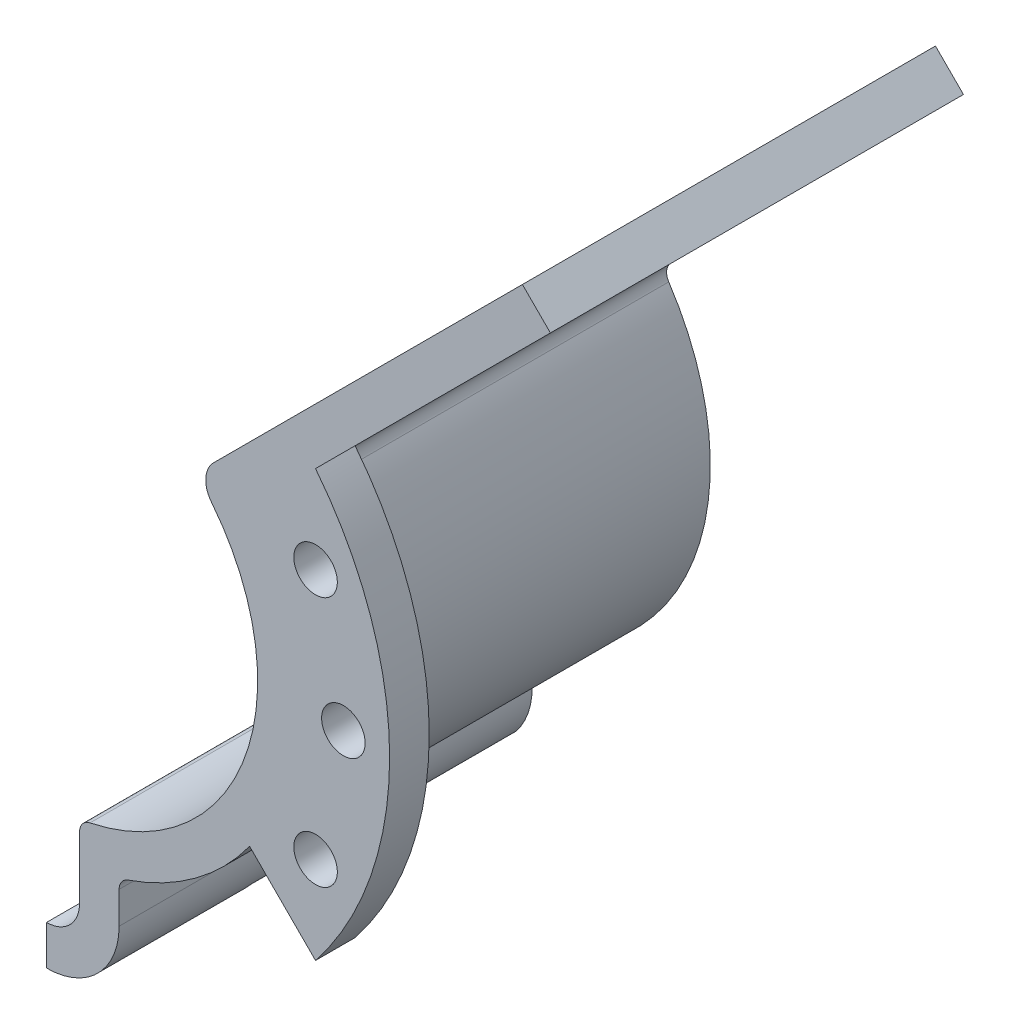
ISO-10303-21;
HEADER;
FILE_DESCRIPTION(('STEP AP214'),'2;1');
FILE_NAME('part.step','',(''),(''),'','','');
FILE_SCHEMA(('AUTOMOTIVE_DESIGN { 1 0 10303 214 1 1 1 1 }'));
ENDSEC;
DATA;
#1=APPLICATION_CONTEXT('core data for automotive mechanical design processes');
#2=APPLICATION_PROTOCOL_DEFINITION('international standard','automotive_design',2000,#1);
#3=PRODUCT_CONTEXT('',#1,'mechanical');
#4=PRODUCT('Part','Part','',(#3));
#5=PRODUCT_RELATED_PRODUCT_CATEGORY('part','',(#4));
#6=PRODUCT_DEFINITION_FORMATION('','',#4);
#7=PRODUCT_DEFINITION_CONTEXT('part definition',#1,'design');
#8=PRODUCT_DEFINITION('design','',#6,#7);
#9=PRODUCT_DEFINITION_SHAPE('','',#8);
#10=(LENGTH_UNIT() NAMED_UNIT(*) SI_UNIT(.MILLI.,.METRE.));
#11=(NAMED_UNIT(*) PLANE_ANGLE_UNIT() SI_UNIT($,.RADIAN.));
#12=(NAMED_UNIT(*) SI_UNIT($,.STERADIAN.) SOLID_ANGLE_UNIT());
#13=UNCERTAINTY_MEASURE_WITH_UNIT(LENGTH_MEASURE(1.E-05),#10,'distance_accuracy_value','');
#14=(GEOMETRIC_REPRESENTATION_CONTEXT(3) GLOBAL_UNCERTAINTY_ASSIGNED_CONTEXT((#13)) GLOBAL_UNIT_ASSIGNED_CONTEXT((#10,
#11,#12)) REPRESENTATION_CONTEXT('',''));
#15=CARTESIAN_POINT('',(0.,0.,0.));
#16=DIRECTION('',(0.,0.,1.));
#17=DIRECTION('',(1.,0.,0.));
#18=AXIS2_PLACEMENT_3D('',#15,#16,#17);
#19=CARTESIAN_POINT('',(0.,-21.3348082018374,-40.2490319383578));
#20=DIRECTION('',(0.,0.,1.));
#21=DIRECTION('',(-1.,0.,0.));
#22=AXIS2_PLACEMENT_3D('',#19,#20,#21);
#23=CYLINDRICAL_SURFACE('',#22,2.49999999999986);
#24=CARTESIAN_POINT('',(0.,-21.3348082018374,-10.));
#25=DIRECTION('',(0.,0.,1.));
#26=DIRECTION('',(1.,0.,0.));
#27=AXIS2_PLACEMENT_3D('',#24,#25,#26);
#28=CIRCLE('',#27,2.49999999999986);
#29=CARTESIAN_POINT('',(2.49999999999986,-21.3348082018374,-10.));
#30=VERTEX_POINT('',#29);
#31=CARTESIAN_POINT('',(0.,-23.8348082018372,-10.));
#32=VERTEX_POINT('',#31);
#33=EDGE_CURVE('E182',#30,#32,#28,.F.);
#34=ORIENTED_EDGE('',*,*,#33,.T.);
#35=DIRECTION('',(0.,0.,1.));
#36=VECTOR('',#35,1.);
#37=CARTESIAN_POINT('',(0.,-23.8348082018372,-40.2490319383578));
#38=LINE('',#37,#36);
#39=CARTESIAN_POINT('',(0.,-23.8348082018372,1.3));
#40=VERTEX_POINT('',#39);
#41=EDGE_CURVE('E204',#32,#40,#38,.T.);
#42=ORIENTED_EDGE('',*,*,#41,.T.);
#43=CARTESIAN_POINT('',(0.,-21.3348082018374,1.3));
#44=DIRECTION('',(0.,0.,-1.));
#45=DIRECTION('',(-1.,0.,0.));
#46=AXIS2_PLACEMENT_3D('',#43,#44,#45);
#47=CIRCLE('',#46,2.49999999999986);
#48=CARTESIAN_POINT('',(2.49999999999986,-21.3348082018374,1.3));
#49=VERTEX_POINT('',#48);
#50=EDGE_CURVE('E184',#49,#40,#47,.T.);
#51=ORIENTED_EDGE('',*,*,#50,.F.);
#52=DIRECTION('',(0.,0.,1.));
#53=VECTOR('',#52,1.);
#54=CARTESIAN_POINT('',(2.49999999999986,-21.3348082018374,-40.2490319383578));
#55=LINE('',#54,#53);
#56=EDGE_CURVE('E169',#30,#49,#55,.T.);
#57=ORIENTED_EDGE('',*,*,#56,.F.);
#58=EDGE_LOOP('',(#34,#42,#51,#57));
#59=FACE_BOUND('',#58,.T.);
#60=ADVANCED_FACE('F35',(#59),#23,.F.);
#61=CARTESIAN_POINT('',(0.,-23.8348082018372,-40.2490319383578));
#62=DIRECTION('',(1.,0.,0.));
#63=DIRECTION('',(0.,1.,0.));
#64=AXIS2_PLACEMENT_3D('',#61,#62,#63);
#65=PLANE('',#64);
#66=DIRECTION('',(0.,-1.,0.));
#67=VECTOR('',#66,1.);
#68=CARTESIAN_POINT('',(0.,-23.8348082018372,-10.));
#69=LINE('',#68,#67);
#70=CARTESIAN_POINT('',(0.,-26.8348082018372,-10.));
#71=VERTEX_POINT('',#70);
#72=EDGE_CURVE('E176',#32,#71,#69,.T.);
#73=ORIENTED_EDGE('',*,*,#72,.T.);
#74=DIRECTION('',(0.,0.,1.));
#75=VECTOR('',#74,1.);
#76=CARTESIAN_POINT('',(0.,-26.8348082018372,-40.2490319383578));
#77=LINE('',#76,#75);
#78=CARTESIAN_POINT('',(0.,-26.8348082018372,1.3));
#79=VERTEX_POINT('',#78);
#80=EDGE_CURVE('E200',#71,#79,#77,.T.);
#81=ORIENTED_EDGE('',*,*,#80,.T.);
#82=DIRECTION('',(0.,-1.,0.));
#83=VECTOR('',#82,1.);
#84=CARTESIAN_POINT('',(0.,-23.8348082018372,1.3));
#85=LINE('',#84,#83);
#86=EDGE_CURVE('E201',#40,#79,#85,.T.);
#87=ORIENTED_EDGE('',*,*,#86,.F.);
#88=ORIENTED_EDGE('',*,*,#41,.F.);
#89=EDGE_LOOP('',(#73,#81,#87,#88));
#90=FACE_BOUND('',#89,.T.);
#91=ADVANCED_FACE('F380',(#90),#65,.F.);
#92=CARTESIAN_POINT('',(0.,0.,-95.4754890815647));
#93=DIRECTION('',(0.,0.,1.));
#94=DIRECTION('',(-1.,0.,0.));
#95=AXIS2_PLACEMENT_3D('',#92,#93,#94);
#96=CYLINDRICAL_SURFACE('',#95,19.);
#97=CARTESIAN_POINT('',(0.,0.,-30.));
#98=DIRECTION('',(0.,0.,1.));
#99=DIRECTION('',(1.,0.,0.));
#100=AXIS2_PLACEMENT_3D('',#97,#98,#99);
#101=CIRCLE('',#100,19.);
#102=CARTESIAN_POINT('',(6.17499999999986,-17.9685663034089,-30.));
#103=VERTEX_POINT('',#102);
#104=CARTESIAN_POINT('',(15.8505919060323,10.4765803690146,-30.));
#105=VERTEX_POINT('',#104);
#106=EDGE_CURVE('E258',#103,#105,#101,.T.);
#107=ORIENTED_EDGE('',*,*,#106,.T.);
#108=DIRECTION('',(0.,0.,1.));
#109=VECTOR('',#108,1.);
#110=CARTESIAN_POINT('',(15.8505919060323,10.4765803690146,-95.4754890815647));
#111=LINE('',#110,#109);
#112=CARTESIAN_POINT('',(15.8505919060323,10.4765803690146,-1.7));
#113=VERTEX_POINT('',#112);
#114=EDGE_CURVE('E293',#113,#105,#111,.F.);
#115=ORIENTED_EDGE('',*,*,#114,.F.);
#116=CARTESIAN_POINT('',(0.,0.,-1.7));
#117=DIRECTION('',(0.,0.,-1.));
#118=DIRECTION('',(1.,0.,0.));
#119=AXIS2_PLACEMENT_3D('',#116,#117,#118);
#120=CIRCLE('',#119,19.);
#121=CARTESIAN_POINT('',(15.3878195049812,-11.145178817862,-1.70000000000001));
#122=VERTEX_POINT('',#121);
#123=EDGE_CURVE('E222',#113,#122,#120,.T.);
#124=ORIENTED_EDGE('',*,*,#123,.T.);
#125=DIRECTION('',(0.,0.,1.));
#126=VECTOR('',#125,1.);
#127=CARTESIAN_POINT('',(15.3878195049812,-11.145178817862,-1.7));
#128=LINE('',#127,#126);
#129=CARTESIAN_POINT('',(15.3878195049812,-11.145178817862,1.3));
#130=VERTEX_POINT('',#129);
#131=EDGE_CURVE('E232',#122,#130,#128,.T.);
#132=ORIENTED_EDGE('',*,*,#131,.T.);
#133=CARTESIAN_POINT('',(0.,0.,1.3));
#134=DIRECTION('',(0.,0.,1.));
#135=DIRECTION('',(1.,0.,0.));
#136=AXIS2_PLACEMENT_3D('',#133,#134,#135);
#137=CIRCLE('',#136,19.);
#138=CARTESIAN_POINT('',(6.17499999999986,-17.9685663034089,1.3));
#139=VERTEX_POINT('',#138);
#140=EDGE_CURVE('E243',#139,#130,#137,.T.);
#141=ORIENTED_EDGE('',*,*,#140,.F.);
#142=DIRECTION('',(0.,0.,1.));
#143=VECTOR('',#142,1.);
#144=CARTESIAN_POINT('',(6.17499999999986,-17.9685663034089,-95.4754890815647));
#145=LINE('',#144,#143);
#146=EDGE_CURVE('E296',#103,#139,#145,.T.);
#147=ORIENTED_EDGE('',*,*,#146,.F.);
#148=EDGE_LOOP('',(#107,#115,#124,#132,#141,#147));
#149=FACE_BOUND('',#148,.T.);
#150=ADVANCED_FACE('F346',(#149),#96,.T.);
#151=CARTESIAN_POINT('',(38.1837661840735,33.9411254969544,-95.4754890815647));
#152=DIRECTION('',(-0.707106781186549,0.707106781186546,0.));
#153=DIRECTION('',(-0.707106781186546,-0.707106781186549,0.));
#154=AXIS2_PLACEMENT_3D('',#151,#152,#153);
#155=PLANE('',#154);
#156=DIRECTION('',(0.707106781186546,0.707106781186549,0.));
#157=VECTOR('',#156,1.);
#158=CARTESIAN_POINT('',(38.1837661840735,33.9411254969544,-30.));
#159=LINE('',#158,#157);
#160=CARTESIAN_POINT('',(15.9777268041106,11.7350861169914,-30.));
#161=VERTEX_POINT('',#160);
#162=CARTESIAN_POINT('',(38.1837661840735,33.9411254969544,-30.));
#163=VERTEX_POINT('',#162);
#164=EDGE_CURVE('E242',#161,#163,#159,.T.);
#165=ORIENTED_EDGE('',*,*,#164,.T.);
#166=DIRECTION('',(0.,0.,1.));
#167=VECTOR('',#166,1.);
#168=CARTESIAN_POINT('',(38.1837661840735,33.9411254969544,-95.4754890815647));
#169=LINE('',#168,#167);
#170=CARTESIAN_POINT('',(38.1837661840735,33.9411254969544,1.3));
#171=VERTEX_POINT('',#170);
#172=EDGE_CURVE('E238',#163,#171,#169,.T.);
#173=ORIENTED_EDGE('',*,*,#172,.T.);
#174=DIRECTION('',(0.707106781186546,0.707106781186549,0.));
#175=VECTOR('',#174,1.);
#176=CARTESIAN_POINT('',(38.1837661840735,33.9411254969544,1.3));
#177=LINE('',#176,#175);
#178=CARTESIAN_POINT('',(20.3833027113093,16.1406620241901,1.3));
#179=VERTEX_POINT('',#178);
#180=EDGE_CURVE('E239',#179,#171,#177,.T.);
#181=ORIENTED_EDGE('',*,*,#180,.F.);
#182=DIRECTION('',(0.,0.,1.));
#183=VECTOR('',#182,1.);
#184=CARTESIAN_POINT('',(20.3833027113093,16.1406620241901,-1.7));
#185=LINE('',#184,#183);
#186=CARTESIAN_POINT('',(20.3833027113093,16.1406620241901,-1.70000000000001));
#187=VERTEX_POINT('',#186);
#188=EDGE_CURVE('E235',#187,#179,#185,.T.);
#189=ORIENTED_EDGE('',*,*,#188,.F.);
#190=DIRECTION('',(-0.707106781186547,-0.707106781186548,0.));
#191=VECTOR('',#190,1.);
#192=CARTESIAN_POINT('',(15.3878195049812,11.145178817862,-1.7));
#193=LINE('',#192,#191);
#194=CARTESIAN_POINT('',(15.9777268041106,11.7350861169914,-1.7));
#195=VERTEX_POINT('',#194);
#196=EDGE_CURVE('E218',#187,#195,#193,.T.);
#197=ORIENTED_EDGE('',*,*,#196,.T.);
#198=DIRECTION('',(0.,0.,-1.));
#199=VECTOR('',#198,1.);
#200=CARTESIAN_POINT('',(15.9777268041106,11.7350861169914,-1.70000000000006));
#201=LINE('',#200,#199);
#202=EDGE_CURVE('E306',#161,#195,#201,.F.);
#203=ORIENTED_EDGE('',*,*,#202,.F.);
#204=EDGE_LOOP('',(#165,#173,#181,#189,#197,#203));
#205=FACE_BOUND('',#204,.T.);
#206=ADVANCED_FACE('F334',(#205),#155,.F.);
#207=CARTESIAN_POINT('',(36.0624458405138,36.062445840514,-95.4754890815647));
#208=DIRECTION('',(-0.707106781186544,-0.707106781186551,0.));
#209=DIRECTION('',(0.707106781186551,-0.707106781186544,0.));
#210=AXIS2_PLACEMENT_3D('',#207,#208,#209);
#211=PLANE('',#210);
#212=DIRECTION('',(-0.707106781186551,0.707106781186544,0.));
#213=VECTOR('',#212,1.);
#214=CARTESIAN_POINT('',(36.0624458405138,36.062445840514,-30.));
#215=LINE('',#214,#213);
#216=CARTESIAN_POINT('',(36.0624458405138,36.062445840514,-30.));
#217=VERTEX_POINT('',#216);
#218=EDGE_CURVE('E270',#163,#217,#215,.T.);
#219=ORIENTED_EDGE('',*,*,#218,.T.);
#220=DIRECTION('',(0.,0.,1.));
#221=VECTOR('',#220,1.);
#222=CARTESIAN_POINT('',(36.0624458405138,36.062445840514,-95.4754890815647));
#223=LINE('',#222,#221);
#224=CARTESIAN_POINT('',(36.0624458405138,36.062445840514,1.3));
#225=VERTEX_POINT('',#224);
#226=EDGE_CURVE('E254',#217,#225,#223,.T.);
#227=ORIENTED_EDGE('',*,*,#226,.T.);
#228=DIRECTION('',(-0.707106781186551,0.707106781186544,0.));
#229=VECTOR('',#228,1.);
#230=CARTESIAN_POINT('',(36.0624458405138,36.062445840514,1.3));
#231=LINE('',#230,#229);
#232=EDGE_CURVE('E255',#171,#225,#231,.T.);
#233=ORIENTED_EDGE('',*,*,#232,.F.);
#234=ORIENTED_EDGE('',*,*,#172,.F.);
#235=EDGE_LOOP('',(#219,#227,#233,#234));
#236=FACE_BOUND('',#235,.T.);
#237=ADVANCED_FACE('F330',(#236),#211,.F.);
#238=CARTESIAN_POINT('',(36.0624458405138,36.062445840514,-95.4754890815647));
#239=DIRECTION('',(0.707106781186549,-0.707106781186546,0.));
#240=DIRECTION('',(0.707106781186546,0.707106781186549,0.));
#241=AXIS2_PLACEMENT_3D('',#238,#239,#240);
#242=PLANE('',#241);
#243=DIRECTION('',(-0.707106781186546,-0.707106781186549,0.));
#244=VECTOR('',#243,1.);
#245=CARTESIAN_POINT('',(36.0624458405138,36.062445840514,1.3));
#246=LINE('',#245,#244);
#247=CARTESIAN_POINT('',(12.6491106406735,12.6491106406735,1.3));
#248=VERTEX_POINT('',#247);
#249=EDGE_CURVE('E251',#225,#248,#246,.T.);
#250=ORIENTED_EDGE('',*,*,#249,.F.);
#251=ORIENTED_EDGE('',*,*,#226,.F.);
#252=DIRECTION('',(-0.707106781186546,-0.707106781186549,0.));
#253=VECTOR('',#252,1.);
#254=CARTESIAN_POINT('',(36.0624458405138,36.062445840514,-30.));
#255=LINE('',#254,#253);
#256=CARTESIAN_POINT('',(12.6491106406735,12.6491106406735,-30.));
#257=VERTEX_POINT('',#256);
#258=EDGE_CURVE('E267',#217,#257,#255,.T.);
#259=ORIENTED_EDGE('',*,*,#258,.T.);
#260=DIRECTION('',(0.,0.,1.));
#261=VECTOR('',#260,1.);
#262=CARTESIAN_POINT('',(12.6491106406735,12.6491106406735,-95.4754890815647));
#263=LINE('',#262,#261);
#264=EDGE_CURVE('E43',#248,#257,#263,.F.);
#265=ORIENTED_EDGE('',*,*,#264,.F.);
#266=EDGE_LOOP('',(#250,#251,#259,#265));
#267=FACE_BOUND('',#266,.T.);
#268=ADVANCED_FACE('F325',(#267),#242,.F.);
#269=CARTESIAN_POINT('',(0.,0.,-95.4754890815647));
#270=DIRECTION('',(0.,0.,1.));
#271=DIRECTION('',(-1.,0.,0.));
#272=AXIS2_PLACEMENT_3D('',#269,#270,#271);
#273=CYLINDRICAL_SURFACE('',#272,16.);
#274=CARTESIAN_POINT('',(0.,0.,-30.));
#275=DIRECTION('',(0.,0.,1.));
#276=DIRECTION('',(1.,0.,0.));
#277=AXIS2_PLACEMENT_3D('',#274,#275,#276);
#278=CIRCLE('',#277,16.);
#279=CARTESIAN_POINT('',(12.5007326249303,9.98657518071152,-30.));
#280=VERTEX_POINT('',#279);
#281=CARTESIAN_POINT('',(3.29411764705869,-15.6572280090486,-30.));
#282=VERTEX_POINT('',#281);
#283=EDGE_CURVE('E264',#280,#282,#278,.F.);
#284=ORIENTED_EDGE('',*,*,#283,.T.);
#285=DIRECTION('',(0.,0.,1.));
#286=VECTOR('',#285,1.);
#287=CARTESIAN_POINT('',(3.29411764705869,-15.6572280090486,-95.4754890815647));
#288=LINE('',#287,#286);
#289=CARTESIAN_POINT('',(3.29411764705869,-15.6572280090486,1.3));
#290=VERTEX_POINT('',#289);
#291=EDGE_CURVE('E303',#290,#282,#288,.F.);
#292=ORIENTED_EDGE('',*,*,#291,.F.);
#293=CARTESIAN_POINT('',(0.,0.,1.3));
#294=DIRECTION('',(0.,0.,-1.));
#295=DIRECTION('',(1.,0.,0.));
#296=AXIS2_PLACEMENT_3D('',#293,#294,#295);
#297=CIRCLE('',#296,16.);
#298=CARTESIAN_POINT('',(12.5007326249303,9.98657518071152,1.3));
#299=VERTEX_POINT('',#298);
#300=EDGE_CURVE('E248',#299,#290,#297,.T.);
#301=ORIENTED_EDGE('',*,*,#300,.F.);
#302=DIRECTION('',(0.,0.,1.));
#303=VECTOR('',#302,1.);
#304=CARTESIAN_POINT('',(12.5007326249303,9.98657518071152,-95.4754890815647));
#305=LINE('',#304,#303);
#306=EDGE_CURVE('E320',#280,#299,#305,.T.);
#307=ORIENTED_EDGE('',*,*,#306,.F.);
#308=EDGE_LOOP('',(#284,#292,#301,#307));
#309=FACE_BOUND('',#308,.T.);
#310=ADVANCED_FACE('F366',(#309),#273,.F.);
#311=CARTESIAN_POINT('',(2.49999999999986,-15.8034806292791,-95.4754890815647));
#312=DIRECTION('',(1.,0.,0.));
#313=DIRECTION('',(0.,0.,1.));
#314=AXIS2_PLACEMENT_3D('',#311,#312,#313);
#315=PLANE('',#314);
#316=DIRECTION('',(0.,1.,0.));
#317=VECTOR('',#316,1.);
#318=CARTESIAN_POINT('',(2.49999999999986,-21.3348082018374,-10.));
#319=LINE('',#318,#317);
#320=CARTESIAN_POINT('',(2.49999999999986,-24.1632353265835,-10.));
#321=VERTEX_POINT('',#320);
#322=EDGE_CURVE('E165',#321,#30,#319,.T.);
#323=ORIENTED_EDGE('',*,*,#322,.T.);
#324=ORIENTED_EDGE('',*,*,#56,.T.);
#325=DIRECTION('',(0.,-1.,0.));
#326=VECTOR('',#325,1.);
#327=CARTESIAN_POINT('',(2.49999999999986,-15.8034806292791,1.3));
#328=LINE('',#327,#326);
#329=CARTESIAN_POINT('',(2.49999999999986,-16.6358047596142,1.3));
#330=VERTEX_POINT('',#329);
#331=EDGE_CURVE('E246',#330,#49,#328,.T.);
#332=ORIENTED_EDGE('',*,*,#331,.F.);
#333=DIRECTION('',(0.,0.,1.));
#334=VECTOR('',#333,1.);
#335=CARTESIAN_POINT('',(2.49999999999986,-16.6358047596142,-95.4754890815647));
#336=LINE('',#335,#334);
#337=CARTESIAN_POINT('',(2.49999999999986,-16.6358047596142,-30.));
#338=VERTEX_POINT('',#337);
#339=EDGE_CURVE('E284',#338,#330,#336,.T.);
#340=ORIENTED_EDGE('',*,*,#339,.F.);
#341=DIRECTION('',(0.,-1.,0.));
#342=VECTOR('',#341,1.);
#343=CARTESIAN_POINT('',(2.49999999999986,-15.8034806292791,-30.));
#344=LINE('',#343,#342);
#345=CARTESIAN_POINT('',(2.49999999999986,-24.1632353265835,-30.));
#346=VERTEX_POINT('',#345);
#347=EDGE_CURVE('E262',#338,#346,#344,.T.);
#348=ORIENTED_EDGE('',*,*,#347,.T.);
#349=DIRECTION('',(0.,0.,1.));
#350=VECTOR('',#349,1.);
#351=CARTESIAN_POINT('',(2.49999999999986,-24.1632353265835,-95.4754890815647));
#352=LINE('',#351,#350);
#353=EDGE_CURVE('E173',#321,#346,#352,.F.);
#354=ORIENTED_EDGE('',*,*,#353,.F.);
#355=EDGE_LOOP('',(#323,#324,#332,#340,#348,#354));
#356=FACE_BOUND('',#355,.T.);
#357=ADVANCED_FACE('F167',(#356),#315,.F.);
#358=CARTESIAN_POINT('',(0.,0.,1.3));
#359=DIRECTION('',(0.,0.,-1.));
#360=DIRECTION('',(1.,0.,0.));
#361=AXIS2_PLACEMENT_3D('',#358,#359,#360);
#362=PLANE('',#361);
#363=CARTESIAN_POINT('',(22.4949455159964,0.,1.3));
#364=DIRECTION('',(0.,0.,1.));
#365=DIRECTION('',(1.,0.,0.));
#366=AXIS2_PLACEMENT_3D('',#363,#364,#365);
#367=CIRCLE('',#366,1.65);
#368=CARTESIAN_POINT('',(24.1449455159964,0.,1.3));
#369=VERTEX_POINT('',#368);
#370=EDGE_CURVE('E610',#369,#369,#367,.T.);
#371=ORIENTED_EDGE('',*,*,#370,.F.);
#372=EDGE_LOOP('',(#371));
#373=FACE_BOUND('',#372,.T.);
#374=CARTESIAN_POINT('',(20.3873442901127,9.50677477192217,1.3));
#375=DIRECTION('',(0.,0.,1.));
#376=DIRECTION('',(1.,0.,0.));
#377=AXIS2_PLACEMENT_3D('',#374,#375,#376);
#378=CIRCLE('',#377,1.65);
#379=CARTESIAN_POINT('',(22.0373442901127,9.50677477192217,1.3));
#380=VERTEX_POINT('',#379);
#381=EDGE_CURVE('E601',#380,#380,#378,.T.);
#382=ORIENTED_EDGE('',*,*,#381,.F.);
#383=EDGE_LOOP('',(#382));
#384=FACE_BOUND('',#383,.T.);
#385=CARTESIAN_POINT('',(20.3873442901127,-9.50677477192216,1.3));
#386=DIRECTION('',(0.,0.,1.));
#387=DIRECTION('',(1.,0.,0.));
#388=AXIS2_PLACEMENT_3D('',#385,#386,#387);
#389=CIRCLE('',#388,1.65);
#390=CARTESIAN_POINT('',(22.0373442901127,-9.50677477192216,1.3));
#391=VERTEX_POINT('',#390);
#392=EDGE_CURVE('E177',#391,#391,#389,.T.);
#393=ORIENTED_EDGE('',*,*,#392,.F.);
#394=EDGE_LOOP('',(#393));
#395=FACE_BOUND('',#394,.T.);
#396=ORIENTED_EDGE('',*,*,#300,.T.);
#397=CARTESIAN_POINT('',(3.49999999999986,-16.6358047596142,1.3));
#398=DIRECTION('',(0.,0.,1.));
#399=DIRECTION('',(1.,0.,0.));
#400=AXIS2_PLACEMENT_3D('',#397,#398,#399);
#401=CIRCLE('',#400,1.);
#402=EDGE_CURVE('E301',#330,#290,#401,.F.);
#403=ORIENTED_EDGE('',*,*,#402,.F.);
#404=ORIENTED_EDGE('',*,*,#331,.T.);
#405=ORIENTED_EDGE('',*,*,#50,.T.);
#406=ORIENTED_EDGE('',*,*,#86,.T.);
#407=CARTESIAN_POINT('',(0.,-21.3348082018374,1.3));
#408=DIRECTION('',(0.,0.,1.));
#409=DIRECTION('',(1.,0.,0.));
#410=AXIS2_PLACEMENT_3D('',#407,#408,#409);
#411=CIRCLE('',#410,5.49999999999986);
#412=CARTESIAN_POINT('',(5.49999999999986,-21.3348082018374,1.3));
#413=VERTEX_POINT('',#412);
#414=EDGE_CURVE('E197',#79,#413,#411,.T.);
#415=ORIENTED_EDGE('',*,*,#414,.T.);
#416=DIRECTION('',(0.,1.,0.));
#417=VECTOR('',#416,1.);
#418=CARTESIAN_POINT('',(5.49999999999986,-21.3348082018374,1.3));
#419=LINE('',#418,#417);
#420=CARTESIAN_POINT('',(5.49999999999986,-18.9142803193778,1.3));
#421=VERTEX_POINT('',#420);
#422=EDGE_CURVE('E192',#413,#421,#419,.T.);
#423=ORIENTED_EDGE('',*,*,#422,.T.);
#424=CARTESIAN_POINT('',(6.49999999999986,-18.9142803193778,1.3));
#425=DIRECTION('',(0.,0.,1.));
#426=DIRECTION('',(1.,0.,0.));
#427=AXIS2_PLACEMENT_3D('',#424,#425,#426);
#428=CIRCLE('',#427,1.);
#429=EDGE_CURVE('E313',#139,#421,#428,.T.);
#430=ORIENTED_EDGE('',*,*,#429,.F.);
#431=ORIENTED_EDGE('',*,*,#140,.T.);
#432=DIRECTION('',(0.707106781186547,-0.707106781186548,0.));
#433=VECTOR('',#432,1.);
#434=CARTESIAN_POINT('',(15.3878195049812,-11.145178817862,1.3));
#435=LINE('',#434,#433);
#436=CARTESIAN_POINT('',(20.3833027113093,-16.1406620241901,1.3));
#437=VERTEX_POINT('',#436);
#438=EDGE_CURVE('E219',#130,#437,#435,.T.);
#439=ORIENTED_EDGE('',*,*,#438,.T.);
#440=CARTESIAN_POINT('',(0.,0.,1.3));
#441=DIRECTION('',(0.,0.,1.));
#442=DIRECTION('',(-1.,0.,0.));
#443=AXIS2_PLACEMENT_3D('',#440,#441,#442);
#444=CIRCLE('',#443,26.);
#445=EDGE_CURVE('E209',#437,#179,#444,.T.);
#446=ORIENTED_EDGE('',*,*,#445,.T.);
#447=ORIENTED_EDGE('',*,*,#180,.T.);
#448=ORIENTED_EDGE('',*,*,#232,.T.);
#449=ORIENTED_EDGE('',*,*,#249,.T.);
#450=CARTESIAN_POINT('',(14.0633242030466,11.2348970783005,1.3));
#451=DIRECTION('',(0.,0.,1.));
#452=DIRECTION('',(1.,0.,0.));
#453=AXIS2_PLACEMENT_3D('',#450,#451,#452);
#454=CIRCLE('',#453,2.);
#455=EDGE_CURVE('E55',#299,#248,#454,.F.);
#456=ORIENTED_EDGE('',*,*,#455,.F.);
#457=EDGE_LOOP('',(#396,#403,#404,#405,#406,#415,#423,#430,#431,#439,#446,#447,#448,#449,#456));
#458=FACE_BOUND('',#457,.T.);
#459=ADVANCED_FACE('F368',(#373,#384,#395,#458),#362,.F.);
#460=CARTESIAN_POINT('',(-13.5,0.,-30.));
#461=DIRECTION('',(0.,0.,-1.));
#462=DIRECTION('',(1.,0.,0.));
#463=AXIS2_PLACEMENT_3D('',#460,#461,#462);
#464=PLANE('',#463);
#465=ORIENTED_EDGE('',*,*,#258,.F.);
#466=ORIENTED_EDGE('',*,*,#218,.F.);
#467=ORIENTED_EDGE('',*,*,#164,.F.);
#468=CARTESIAN_POINT('',(16.6848335852972,11.0279793358049,-30.));
#469=DIRECTION('',(0.,0.,1.));
#470=DIRECTION('',(1.,0.,0.));
#471=AXIS2_PLACEMENT_3D('',#468,#469,#470);
#472=CIRCLE('',#471,1.);
#473=EDGE_CURVE('E318',#105,#161,#472,.F.);
#474=ORIENTED_EDGE('',*,*,#473,.F.);
#475=ORIENTED_EDGE('',*,*,#106,.F.);
#476=CARTESIAN_POINT('',(6.49999999999986,-18.9142803193778,-30.));
#477=DIRECTION('',(0.,0.,1.));
#478=DIRECTION('',(1.,0.,0.));
#479=AXIS2_PLACEMENT_3D('',#476,#477,#478);
#480=CIRCLE('',#479,1.);
#481=CARTESIAN_POINT('',(5.49999999999986,-18.9142803193778,-30.));
#482=VERTEX_POINT('',#481);
#483=EDGE_CURVE('E316',#482,#103,#480,.F.);
#484=ORIENTED_EDGE('',*,*,#483,.F.);
#485=DIRECTION('',(0.,1.,0.));
#486=VECTOR('',#485,1.);
#487=CARTESIAN_POINT('',(5.49999999999986,-21.3348082018374,-30.));
#488=LINE('',#487,#486);
#489=CARTESIAN_POINT('',(5.49999999999986,-21.3348082018374,-30.));
#490=VERTEX_POINT('',#489);
#491=EDGE_CURVE('E195',#490,#482,#488,.T.);
#492=ORIENTED_EDGE('',*,*,#491,.F.);
#493=CARTESIAN_POINT('',(0.,-21.3348082018374,-30.));
#494=DIRECTION('',(0.,0.,1.));
#495=DIRECTION('',(1.,0.,0.));
#496=AXIS2_PLACEMENT_3D('',#493,#494,#495);
#497=CIRCLE('',#496,5.49999999999986);
#498=CARTESIAN_POINT('',(4.27777777777763,-24.7917746876382,-30.));
#499=VERTEX_POINT('',#498);
#500=EDGE_CURVE('E206',#499,#490,#497,.T.);
#501=ORIENTED_EDGE('',*,*,#500,.F.);
#502=CARTESIAN_POINT('',(3.49999999999986,-24.1632353265835,-30.));
#503=DIRECTION('',(0.,0.,1.));
#504=DIRECTION('',(1.,0.,0.));
#505=AXIS2_PLACEMENT_3D('',#502,#503,#504);
#506=CIRCLE('',#505,1.);
#507=EDGE_CURVE('E290',#346,#499,#506,.T.);
#508=ORIENTED_EDGE('',*,*,#507,.F.);
#509=ORIENTED_EDGE('',*,*,#347,.F.);
#510=CARTESIAN_POINT('',(3.49999999999986,-16.6358047596142,-30.));
#511=DIRECTION('',(0.,0.,1.));
#512=DIRECTION('',(1.,0.,0.));
#513=AXIS2_PLACEMENT_3D('',#510,#511,#512);
#514=CIRCLE('',#513,1.);
#515=EDGE_CURVE('E288',#282,#338,#514,.T.);
#516=ORIENTED_EDGE('',*,*,#515,.F.);
#517=ORIENTED_EDGE('',*,*,#283,.F.);
#518=CARTESIAN_POINT('',(14.0633242030466,11.2348970783005,-30.));
#519=DIRECTION('',(0.,0.,1.));
#520=DIRECTION('',(1.,0.,0.));
#521=AXIS2_PLACEMENT_3D('',#518,#519,#520);
#522=CIRCLE('',#521,2.);
#523=EDGE_CURVE('E11',#257,#280,#522,.T.);
#524=ORIENTED_EDGE('',*,*,#523,.F.);
#525=EDGE_LOOP('',(#465,#466,#467,#474,#475,#484,#492,#501,#508,#509,#516,#517,#524));
#526=FACE_BOUND('',#525,.T.);
#527=ADVANCED_FACE('F326',(#526),#464,.T.);
#528=CARTESIAN_POINT('',(0.,0.,-1.7));
#529=DIRECTION('',(0.,0.,1.));
#530=DIRECTION('',(-1.,0.,0.));
#531=AXIS2_PLACEMENT_3D('',#528,#529,#530);
#532=CYLINDRICAL_SURFACE('',#531,26.);
#533=ORIENTED_EDGE('',*,*,#445,.F.);
#534=DIRECTION('',(0.,0.,1.));
#535=VECTOR('',#534,1.);
#536=CARTESIAN_POINT('',(20.3833027113093,-16.1406620241901,-1.7));
#537=LINE('',#536,#535);
#538=CARTESIAN_POINT('',(20.3833027113093,-16.1406620241901,-1.7));
#539=VERTEX_POINT('',#538);
#540=EDGE_CURVE('E227',#539,#437,#537,.T.);
#541=ORIENTED_EDGE('',*,*,#540,.F.);
#542=CARTESIAN_POINT('',(0.,0.,-1.7));
#543=DIRECTION('',(0.,0.,1.));
#544=DIRECTION('',(-1.,0.,0.));
#545=AXIS2_PLACEMENT_3D('',#542,#543,#544);
#546=CIRCLE('',#545,26.);
#547=EDGE_CURVE('E216',#539,#187,#546,.T.);
#548=ORIENTED_EDGE('',*,*,#547,.T.);
#549=ORIENTED_EDGE('',*,*,#188,.T.);
#550=EDGE_LOOP('',(#533,#541,#548,#549));
#551=FACE_BOUND('',#550,.T.);
#552=ADVANCED_FACE('F371',(#551),#532,.T.);
#553=CARTESIAN_POINT('',(15.3878195049812,-11.145178817862,-1.7));
#554=DIRECTION('',(0.707106781186548,0.707106781186547,0.));
#555=DIRECTION('',(-0.707106781186547,0.707106781186548,0.));
#556=AXIS2_PLACEMENT_3D('',#553,#554,#555);
#557=PLANE('',#556);
#558=ORIENTED_EDGE('',*,*,#438,.F.);
#559=ORIENTED_EDGE('',*,*,#131,.F.);
#560=DIRECTION('',(0.707106781186547,-0.707106781186548,0.));
#561=VECTOR('',#560,1.);
#562=CARTESIAN_POINT('',(15.3878195049812,-11.145178817862,-1.7));
#563=LINE('',#562,#561);
#564=EDGE_CURVE('E225',#122,#539,#563,.T.);
#565=ORIENTED_EDGE('',*,*,#564,.T.);
#566=ORIENTED_EDGE('',*,*,#540,.T.);
#567=EDGE_LOOP('',(#558,#559,#565,#566));
#568=FACE_BOUND('',#567,.T.);
#569=ADVANCED_FACE('F378',(#568),#557,.F.);
#570=CARTESIAN_POINT('',(0.,0.,-1.7));
#571=DIRECTION('',(0.,0.,1.));
#572=DIRECTION('',(-1.,0.,0.));
#573=AXIS2_PLACEMENT_3D('',#570,#571,#572);
#574=PLANE('',#573);
#575=CARTESIAN_POINT('',(22.4949455159964,0.,-1.7));
#576=DIRECTION('',(0.,0.,1.));
#577=DIRECTION('',(1.,0.,0.));
#578=AXIS2_PLACEMENT_3D('',#575,#576,#577);
#579=CIRCLE('',#578,1.65);
#580=CARTESIAN_POINT('',(24.1449455159964,0.,-1.7));
#581=VERTEX_POINT('',#580);
#582=EDGE_CURVE('E613',#581,#581,#579,.T.);
#583=ORIENTED_EDGE('',*,*,#582,.T.);
#584=EDGE_LOOP('',(#583));
#585=FACE_BOUND('',#584,.T.);
#586=CARTESIAN_POINT('',(20.3873442901127,9.50677477192217,-1.7));
#587=DIRECTION('',(0.,0.,1.));
#588=DIRECTION('',(1.,0.,0.));
#589=AXIS2_PLACEMENT_3D('',#586,#587,#588);
#590=CIRCLE('',#589,1.65);
#591=CARTESIAN_POINT('',(22.0373442901127,9.50677477192217,-1.7));
#592=VERTEX_POINT('',#591);
#593=EDGE_CURVE('E605',#592,#592,#590,.T.);
#594=ORIENTED_EDGE('',*,*,#593,.T.);
#595=EDGE_LOOP('',(#594));
#596=FACE_BOUND('',#595,.T.);
#597=CARTESIAN_POINT('',(20.3873442901127,-9.50677477192216,-1.7));
#598=DIRECTION('',(0.,0.,1.));
#599=DIRECTION('',(1.,0.,0.));
#600=AXIS2_PLACEMENT_3D('',#597,#598,#599);
#601=CIRCLE('',#600,1.65);
#602=CARTESIAN_POINT('',(22.0373442901127,-9.50677477192216,-1.7));
#603=VERTEX_POINT('',#602);
#604=EDGE_CURVE('E599',#603,#603,#601,.T.);
#605=ORIENTED_EDGE('',*,*,#604,.T.);
#606=EDGE_LOOP('',(#605));
#607=FACE_BOUND('',#606,.T.);
#608=ORIENTED_EDGE('',*,*,#196,.F.);
#609=ORIENTED_EDGE('',*,*,#547,.F.);
#610=ORIENTED_EDGE('',*,*,#564,.F.);
#611=ORIENTED_EDGE('',*,*,#123,.F.);
#612=CARTESIAN_POINT('',(16.6848335852972,11.0279793358049,-1.70000000000001));
#613=DIRECTION('',(0.,0.,-1.));
#614=DIRECTION('',(-1.,0.,0.));
#615=AXIS2_PLACEMENT_3D('',#612,#613,#614);
#616=CIRCLE('',#615,1.);
#617=EDGE_CURVE('E309',#195,#113,#616,.F.);
#618=ORIENTED_EDGE('',*,*,#617,.F.);
#619=EDGE_LOOP('',(#608,#609,#610,#611,#618));
#620=FACE_BOUND('',#619,.T.);
#621=ADVANCED_FACE('F375',(#585,#596,#607,#620),#574,.F.);
#622=CARTESIAN_POINT('',(0.,-21.3348082018374,-40.2490319383578));
#623=DIRECTION('',(0.,0.,1.));
#624=DIRECTION('',(-1.,0.,0.));
#625=AXIS2_PLACEMENT_3D('',#622,#623,#624);
#626=CYLINDRICAL_SURFACE('',#625,5.49999999999986);
#627=ORIENTED_EDGE('',*,*,#500,.T.);
#628=DIRECTION('',(0.,0.,1.));
#629=VECTOR('',#628,1.);
#630=CARTESIAN_POINT('',(5.49999999999986,-21.3348082018374,-40.2490319383578));
#631=LINE('',#630,#629);
#632=EDGE_CURVE('E196',#490,#413,#631,.T.);
#633=ORIENTED_EDGE('',*,*,#632,.T.);
#634=ORIENTED_EDGE('',*,*,#414,.F.);
#635=ORIENTED_EDGE('',*,*,#80,.F.);
#636=CARTESIAN_POINT('',(0.,-21.3348082018374,-10.));
#637=DIRECTION('',(0.,0.,1.));
#638=DIRECTION('',(1.,0.,0.));
#639=AXIS2_PLACEMENT_3D('',#636,#637,#638);
#640=CIRCLE('',#639,5.49999999999986);
#641=CARTESIAN_POINT('',(4.27777777777763,-24.7917746876382,-10.));
#642=VERTEX_POINT('',#641);
#643=EDGE_CURVE('E261',#71,#642,#640,.T.);
#644=ORIENTED_EDGE('',*,*,#643,.T.);
#645=DIRECTION('',(0.,0.,1.));
#646=VECTOR('',#645,1.);
#647=CARTESIAN_POINT('',(4.27777777777763,-24.7917746876382,-40.2490319383578));
#648=LINE('',#647,#646);
#649=EDGE_CURVE('E281',#499,#642,#648,.T.);
#650=ORIENTED_EDGE('',*,*,#649,.F.);
#651=EDGE_LOOP('',(#627,#633,#634,#635,#644,#650));
#652=FACE_BOUND('',#651,.T.);
#653=ADVANCED_FACE('F356',(#652),#626,.T.);
#654=CARTESIAN_POINT('',(5.49999999999986,-21.3348082018374,-40.2490319383578));
#655=DIRECTION('',(-1.,0.,0.));
#656=DIRECTION('',(0.,0.,-1.));
#657=AXIS2_PLACEMENT_3D('',#654,#655,#656);
#658=PLANE('',#657);
#659=ORIENTED_EDGE('',*,*,#422,.F.);
#660=ORIENTED_EDGE('',*,*,#632,.F.);
#661=ORIENTED_EDGE('',*,*,#491,.T.);
#662=DIRECTION('',(0.,0.,-1.));
#663=VECTOR('',#662,1.);
#664=CARTESIAN_POINT('',(5.49999999999986,-18.9142803193778,-30.));
#665=LINE('',#664,#663);
#666=EDGE_CURVE('E299',#421,#482,#665,.T.);
#667=ORIENTED_EDGE('',*,*,#666,.F.);
#668=EDGE_LOOP('',(#659,#660,#661,#667));
#669=FACE_BOUND('',#668,.T.);
#670=ADVANCED_FACE('F352',(#669),#658,.F.);
#671=CARTESIAN_POINT('',(0.,0.,-10.));
#672=DIRECTION('',(0.,0.,-1.));
#673=DIRECTION('',(1.,0.,0.));
#674=AXIS2_PLACEMENT_3D('',#671,#672,#673);
#675=PLANE('',#674);
#676=ORIENTED_EDGE('',*,*,#33,.F.);
#677=ORIENTED_EDGE('',*,*,#322,.F.);
#678=CARTESIAN_POINT('',(3.49999999999986,-24.1632353265835,-10.));
#679=DIRECTION('',(0.,0.,1.));
#680=DIRECTION('',(1.,0.,0.));
#681=AXIS2_PLACEMENT_3D('',#678,#679,#680);
#682=CIRCLE('',#681,1.);
#683=EDGE_CURVE('E311',#642,#321,#682,.F.);
#684=ORIENTED_EDGE('',*,*,#683,.F.);
#685=ORIENTED_EDGE('',*,*,#643,.F.);
#686=ORIENTED_EDGE('',*,*,#72,.F.);
#687=EDGE_LOOP('',(#676,#677,#684,#685,#686));
#688=FACE_BOUND('',#687,.T.);
#689=ADVANCED_FACE('F186',(#688),#675,.T.);
#690=CARTESIAN_POINT('',(20.3873442901127,-9.50677477192216,-1.7));
#691=DIRECTION('',(0.,0.,-1.));
#692=DIRECTION('',(1.,0.,0.));
#693=AXIS2_PLACEMENT_3D('',#690,#691,#692);
#694=CYLINDRICAL_SURFACE('',#693,1.65);
#695=ORIENTED_EDGE('',*,*,#392,.T.);
#696=EDGE_LOOP('',(#695));
#697=FACE_BOUND('',#696,.T.);
#698=ORIENTED_EDGE('',*,*,#604,.F.);
#699=EDGE_LOOP('',(#698));
#700=FACE_BOUND('',#699,.T.);
#701=ADVANCED_FACE('F467',(#697,#700),#694,.F.);
#702=CARTESIAN_POINT('',(20.3873442901127,9.50677477192217,-1.7));
#703=DIRECTION('',(0.,0.,-1.));
#704=DIRECTION('',(1.,0.,0.));
#705=AXIS2_PLACEMENT_3D('',#702,#703,#704);
#706=CYLINDRICAL_SURFACE('',#705,1.65);
#707=ORIENTED_EDGE('',*,*,#381,.T.);
#708=EDGE_LOOP('',(#707));
#709=FACE_BOUND('',#708,.T.);
#710=ORIENTED_EDGE('',*,*,#593,.F.);
#711=EDGE_LOOP('',(#710));
#712=FACE_BOUND('',#711,.T.);
#713=ADVANCED_FACE('F457',(#709,#712),#706,.F.);
#714=CARTESIAN_POINT('',(22.4949455159964,0.,-1.7));
#715=DIRECTION('',(0.,0.,-1.));
#716=DIRECTION('',(1.,0.,0.));
#717=AXIS2_PLACEMENT_3D('',#714,#715,#716);
#718=CYLINDRICAL_SURFACE('',#717,1.65);
#719=ORIENTED_EDGE('',*,*,#370,.T.);
#720=EDGE_LOOP('',(#719));
#721=FACE_BOUND('',#720,.T.);
#722=ORIENTED_EDGE('',*,*,#582,.F.);
#723=EDGE_LOOP('',(#722));
#724=FACE_BOUND('',#723,.T.);
#725=ADVANCED_FACE('F416',(#721,#724),#718,.F.);
#726=CARTESIAN_POINT('',(3.49999999999986,-24.1632353265835,-40.2490319383578));
#727=DIRECTION('',(0.,0.,1.));
#728=DIRECTION('',(-1.,0.,0.));
#729=AXIS2_PLACEMENT_3D('',#726,#727,#728);
#730=CYLINDRICAL_SURFACE('',#729,1.);
#731=ORIENTED_EDGE('',*,*,#507,.T.);
#732=ORIENTED_EDGE('',*,*,#649,.T.);
#733=ORIENTED_EDGE('',*,*,#683,.T.);
#734=ORIENTED_EDGE('',*,*,#353,.T.);
#735=EDGE_LOOP('',(#731,#732,#733,#734));
#736=FACE_BOUND('',#735,.T.);
#737=ADVANCED_FACE('F359',(#736),#730,.T.);
#738=CARTESIAN_POINT('',(6.49999999999986,-18.9142803193778,-95.4754890815647));
#739=DIRECTION('',(0.,0.,1.));
#740=DIRECTION('',(-1.,0.,0.));
#741=AXIS2_PLACEMENT_3D('',#738,#739,#740);
#742=CYLINDRICAL_SURFACE('',#741,1.);
#743=ORIENTED_EDGE('',*,*,#483,.T.);
#744=ORIENTED_EDGE('',*,*,#146,.T.);
#745=ORIENTED_EDGE('',*,*,#429,.T.);
#746=ORIENTED_EDGE('',*,*,#666,.T.);
#747=EDGE_LOOP('',(#743,#744,#745,#746));
#748=FACE_BOUND('',#747,.T.);
#749=ADVANCED_FACE('F349',(#748),#742,.F.);
#750=CARTESIAN_POINT('',(3.49999999999986,-16.6358047596142,-95.4754890815647));
#751=DIRECTION('',(0.,0.,1.));
#752=DIRECTION('',(-1.,0.,0.));
#753=AXIS2_PLACEMENT_3D('',#750,#751,#752);
#754=CYLINDRICAL_SURFACE('',#753,1.);
#755=ORIENTED_EDGE('',*,*,#515,.T.);
#756=ORIENTED_EDGE('',*,*,#339,.T.);
#757=ORIENTED_EDGE('',*,*,#402,.T.);
#758=ORIENTED_EDGE('',*,*,#291,.T.);
#759=EDGE_LOOP('',(#755,#756,#757,#758));
#760=FACE_BOUND('',#759,.T.);
#761=ADVANCED_FACE('F363',(#760),#754,.T.);
#762=CARTESIAN_POINT('',(16.6848335852972,11.0279793358049,-95.4754890815647));
#763=DIRECTION('',(0.,0.,1.));
#764=DIRECTION('',(-1.,0.,0.));
#765=AXIS2_PLACEMENT_3D('',#762,#763,#764);
#766=CYLINDRICAL_SURFACE('',#765,1.);
#767=ORIENTED_EDGE('',*,*,#473,.T.);
#768=ORIENTED_EDGE('',*,*,#202,.T.);
#769=ORIENTED_EDGE('',*,*,#617,.T.);
#770=ORIENTED_EDGE('',*,*,#114,.T.);
#771=EDGE_LOOP('',(#767,#768,#769,#770));
#772=FACE_BOUND('',#771,.T.);
#773=ADVANCED_FACE('F338',(#772),#766,.F.);
#774=CARTESIAN_POINT('',(14.0633242030466,11.2348970783005,-95.4754890815647));
#775=DIRECTION('',(0.,0.,1.));
#776=DIRECTION('',(-1.,0.,0.));
#777=AXIS2_PLACEMENT_3D('',#774,#775,#776);
#778=CYLINDRICAL_SURFACE('',#777,2.);
#779=ORIENTED_EDGE('',*,*,#523,.T.);
#780=ORIENTED_EDGE('',*,*,#306,.T.);
#781=ORIENTED_EDGE('',*,*,#455,.T.);
#782=ORIENTED_EDGE('',*,*,#264,.T.);
#783=EDGE_LOOP('',(#779,#780,#781,#782));
#784=FACE_BOUND('',#783,.T.);
#785=ADVANCED_FACE('F37',(#784),#778,.T.);
#786=CLOSED_SHELL('',(#60,#91,#150,#206,#237,#268,#310,#357,#459,#527,#552,#569,#621,#653,#670,
#689,#701,#713,#725,#737,#749,#761,#773,#785));
#787=MANIFOLD_SOLID_BREP('B2',#786);
#788=ADVANCED_BREP_SHAPE_REPRESENTATION('',(#18,#787),#14);
#789=SHAPE_DEFINITION_REPRESENTATION(#9,#788);
ENDSEC;
END-ISO-10303-21;
